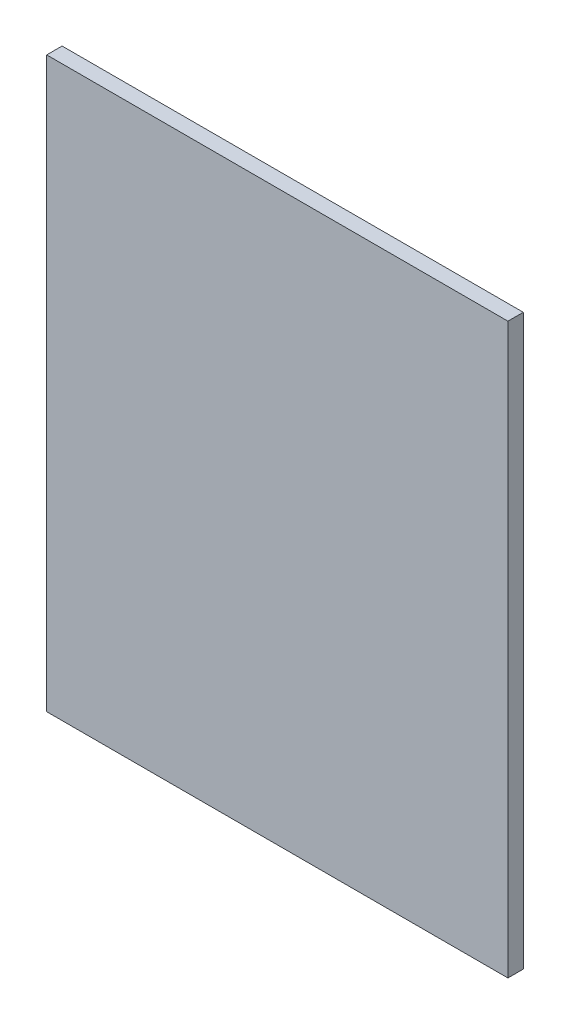
ISO-10303-21;
HEADER;
FILE_DESCRIPTION(('STEP AP214'),'2;1');
FILE_NAME('part.step','',(''),(''),'','','');
FILE_SCHEMA(('AUTOMOTIVE_DESIGN { 1 0 10303 214 1 1 1 1 }'));
ENDSEC;
DATA;
#1=APPLICATION_CONTEXT('core data for automotive mechanical design processes');
#2=APPLICATION_PROTOCOL_DEFINITION('international standard','automotive_design',2000,#1);
#3=PRODUCT_CONTEXT('',#1,'mechanical');
#4=PRODUCT('Part','Part','',(#3));
#5=PRODUCT_RELATED_PRODUCT_CATEGORY('part','',(#4));
#6=PRODUCT_DEFINITION_FORMATION('','',#4);
#7=PRODUCT_DEFINITION_CONTEXT('part definition',#1,'design');
#8=PRODUCT_DEFINITION('design','',#6,#7);
#9=PRODUCT_DEFINITION_SHAPE('','',#8);
#10=(LENGTH_UNIT() NAMED_UNIT(*) SI_UNIT(.MILLI.,.METRE.));
#11=(NAMED_UNIT(*) PLANE_ANGLE_UNIT() SI_UNIT($,.RADIAN.));
#12=(NAMED_UNIT(*) SI_UNIT($,.STERADIAN.) SOLID_ANGLE_UNIT());
#13=UNCERTAINTY_MEASURE_WITH_UNIT(LENGTH_MEASURE(1.E-05),#10,'distance_accuracy_value','');
#14=(GEOMETRIC_REPRESENTATION_CONTEXT(3) GLOBAL_UNCERTAINTY_ASSIGNED_CONTEXT((#13)) GLOBAL_UNIT_ASSIGNED_CONTEXT((#10,
#11,#12)) REPRESENTATION_CONTEXT('',''));
#15=CARTESIAN_POINT('',(0.,0.,0.));
#16=DIRECTION('',(0.,0.,1.));
#17=DIRECTION('',(1.,0.,0.));
#18=AXIS2_PLACEMENT_3D('',#15,#16,#17);
#19=CARTESIAN_POINT('',(-48.4461516694963,-336.460356536502,10.));
#20=DIRECTION('',(1.,0.,0.));
#21=DIRECTION('',(0.,0.,-1.));
#22=AXIS2_PLACEMENT_3D('',#19,#20,#21);
#23=PLANE('',#22);
#24=DIRECTION('',(0.,-1.,0.));
#25=VECTOR('',#24,1.);
#26=CARTESIAN_POINT('',(-48.4461516694963,-336.460356536502,0.));
#27=LINE('',#26,#25);
#28=CARTESIAN_POINT('',(-48.4461516694963,33.5396434634975,0.));
#29=VERTEX_POINT('',#28);
#30=CARTESIAN_POINT('',(-48.4461516694963,-336.460356536502,0.));
#31=VERTEX_POINT('',#30);
#32=EDGE_CURVE('E98',#29,#31,#27,.T.);
#33=ORIENTED_EDGE('',*,*,#32,.T.);
#34=DIRECTION('',(0.,0.,-1.));
#35=VECTOR('',#34,1.);
#36=CARTESIAN_POINT('',(-48.4461516694963,-336.460356536502,10.));
#37=LINE('',#36,#35);
#38=CARTESIAN_POINT('',(-48.4461516694963,-336.460356536502,10.));
#39=VERTEX_POINT('',#38);
#40=EDGE_CURVE('E11',#39,#31,#37,.T.);
#41=ORIENTED_EDGE('',*,*,#40,.F.);
#42=DIRECTION('',(0.,-1.,0.));
#43=VECTOR('',#42,1.);
#44=CARTESIAN_POINT('',(-48.4461516694963,-336.460356536502,10.));
#45=LINE('',#44,#43);
#46=CARTESIAN_POINT('',(-48.4461516694963,33.5396434634975,10.));
#47=VERTEX_POINT('',#46);
#48=EDGE_CURVE('E86',#47,#39,#45,.T.);
#49=ORIENTED_EDGE('',*,*,#48,.F.);
#50=DIRECTION('',(0.,0.,-1.));
#51=VECTOR('',#50,1.);
#52=CARTESIAN_POINT('',(-48.4461516694963,33.5396434634975,10.));
#53=LINE('',#52,#51);
#54=EDGE_CURVE('E94',#47,#29,#53,.T.);
#55=ORIENTED_EDGE('',*,*,#54,.T.);
#56=EDGE_LOOP('',(#33,#41,#49,#55));
#57=FACE_BOUND('',#56,.T.);
#58=ADVANCED_FACE('F35',(#57),#23,.F.);
#59=CARTESIAN_POINT('',(251.553848330504,-336.460356536502,10.));
#60=DIRECTION('',(0.,1.,0.));
#61=DIRECTION('',(0.,0.,1.));
#62=AXIS2_PLACEMENT_3D('',#59,#60,#61);
#63=PLANE('',#62);
#64=DIRECTION('',(1.,0.,0.));
#65=VECTOR('',#64,1.);
#66=CARTESIAN_POINT('',(251.553848330504,-336.460356536502,0.));
#67=LINE('',#66,#65);
#68=CARTESIAN_POINT('',(251.553848330504,-336.460356536502,0.));
#69=VERTEX_POINT('',#68);
#70=EDGE_CURVE('E90',#31,#69,#67,.T.);
#71=ORIENTED_EDGE('',*,*,#70,.T.);
#72=DIRECTION('',(0.,0.,-1.));
#73=VECTOR('',#72,1.);
#74=CARTESIAN_POINT('',(251.553848330504,-336.460356536502,10.));
#75=LINE('',#74,#73);
#76=CARTESIAN_POINT('',(251.553848330504,-336.460356536502,10.));
#77=VERTEX_POINT('',#76);
#78=EDGE_CURVE('E43',#77,#69,#75,.T.);
#79=ORIENTED_EDGE('',*,*,#78,.F.);
#80=DIRECTION('',(1.,0.,0.));
#81=VECTOR('',#80,1.);
#82=CARTESIAN_POINT('',(251.553848330504,-336.460356536502,10.));
#83=LINE('',#82,#81);
#84=EDGE_CURVE('E81',#39,#77,#83,.T.);
#85=ORIENTED_EDGE('',*,*,#84,.F.);
#86=ORIENTED_EDGE('',*,*,#40,.T.);
#87=EDGE_LOOP('',(#71,#79,#85,#86));
#88=FACE_BOUND('',#87,.T.);
#89=ADVANCED_FACE('F89',(#88),#63,.F.);
#90=CARTESIAN_POINT('',(251.553848330504,33.5396434634975,10.));
#91=DIRECTION('',(-1.,0.,0.));
#92=DIRECTION('',(0.,0.,1.));
#93=AXIS2_PLACEMENT_3D('',#90,#91,#92);
#94=PLANE('',#93);
#95=DIRECTION('',(0.,1.,0.));
#96=VECTOR('',#95,1.);
#97=CARTESIAN_POINT('',(251.553848330504,33.5396434634975,0.));
#98=LINE('',#97,#96);
#99=CARTESIAN_POINT('',(251.553848330504,33.5396434634975,0.));
#100=VERTEX_POINT('',#99);
#101=EDGE_CURVE('E68',#69,#100,#98,.T.);
#102=ORIENTED_EDGE('',*,*,#101,.T.);
#103=DIRECTION('',(0.,0.,-1.));
#104=VECTOR('',#103,1.);
#105=CARTESIAN_POINT('',(251.553848330504,33.5396434634975,10.));
#106=LINE('',#105,#104);
#107=CARTESIAN_POINT('',(251.553848330504,33.5396434634975,10.));
#108=VERTEX_POINT('',#107);
#109=EDGE_CURVE('E91',#108,#100,#106,.T.);
#110=ORIENTED_EDGE('',*,*,#109,.F.);
#111=DIRECTION('',(0.,1.,0.));
#112=VECTOR('',#111,1.);
#113=CARTESIAN_POINT('',(251.553848330504,33.5396434634975,10.));
#114=LINE('',#113,#112);
#115=EDGE_CURVE('E84',#77,#108,#114,.T.);
#116=ORIENTED_EDGE('',*,*,#115,.F.);
#117=ORIENTED_EDGE('',*,*,#78,.T.);
#118=EDGE_LOOP('',(#102,#110,#116,#117));
#119=FACE_BOUND('',#118,.T.);
#120=ADVANCED_FACE('F92',(#119),#94,.F.);
#121=CARTESIAN_POINT('',(-48.4461516694963,33.5396434634975,10.));
#122=DIRECTION('',(0.,-1.,0.));
#123=DIRECTION('',(0.,0.,-1.));
#124=AXIS2_PLACEMENT_3D('',#121,#122,#123);
#125=PLANE('',#124);
#126=DIRECTION('',(-1.,0.,0.));
#127=VECTOR('',#126,1.);
#128=CARTESIAN_POINT('',(-48.4461516694963,33.5396434634975,0.));
#129=LINE('',#128,#127);
#130=EDGE_CURVE('E74',#100,#29,#129,.T.);
#131=ORIENTED_EDGE('',*,*,#130,.T.);
#132=ORIENTED_EDGE('',*,*,#54,.F.);
#133=DIRECTION('',(-1.,0.,0.));
#134=VECTOR('',#133,1.);
#135=CARTESIAN_POINT('',(-48.4461516694963,33.5396434634975,10.));
#136=LINE('',#135,#134);
#137=EDGE_CURVE('E51',#108,#47,#136,.T.);
#138=ORIENTED_EDGE('',*,*,#137,.F.);
#139=ORIENTED_EDGE('',*,*,#109,.T.);
#140=EDGE_LOOP('',(#131,#132,#138,#139));
#141=FACE_BOUND('',#140,.T.);
#142=ADVANCED_FACE('F105',(#141),#125,.F.);
#143=CARTESIAN_POINT('',(0.,0.,10.));
#144=DIRECTION('',(0.,0.,-1.));
#145=DIRECTION('',(-1.,0.,0.));
#146=AXIS2_PLACEMENT_3D('',#143,#144,#145);
#147=PLANE('',#146);
#148=ORIENTED_EDGE('',*,*,#48,.T.);
#149=ORIENTED_EDGE('',*,*,#84,.T.);
#150=ORIENTED_EDGE('',*,*,#115,.T.);
#151=ORIENTED_EDGE('',*,*,#137,.T.);
#152=EDGE_LOOP('',(#148,#149,#150,#151));
#153=FACE_BOUND('',#152,.T.);
#154=ADVANCED_FACE('F82',(#153),#147,.F.);
#155=CARTESIAN_POINT('',(0.,0.,0.));
#156=DIRECTION('',(0.,0.,-1.));
#157=DIRECTION('',(-1.,0.,0.));
#158=AXIS2_PLACEMENT_3D('',#155,#156,#157);
#159=PLANE('',#158);
#160=ORIENTED_EDGE('',*,*,#32,.F.);
#161=ORIENTED_EDGE('',*,*,#130,.F.);
#162=ORIENTED_EDGE('',*,*,#101,.F.);
#163=ORIENTED_EDGE('',*,*,#70,.F.);
#164=EDGE_LOOP('',(#160,#161,#162,#163));
#165=FACE_BOUND('',#164,.T.);
#166=ADVANCED_FACE('F108',(#165),#159,.T.);
#167=CLOSED_SHELL('',(#58,#89,#120,#142,#154,#166));
#168=MANIFOLD_SOLID_BREP('B2',#167);
#169=ADVANCED_BREP_SHAPE_REPRESENTATION('',(#18,#168),#14);
#170=SHAPE_DEFINITION_REPRESENTATION(#9,#169);
ENDSEC;
END-ISO-10303-21;
